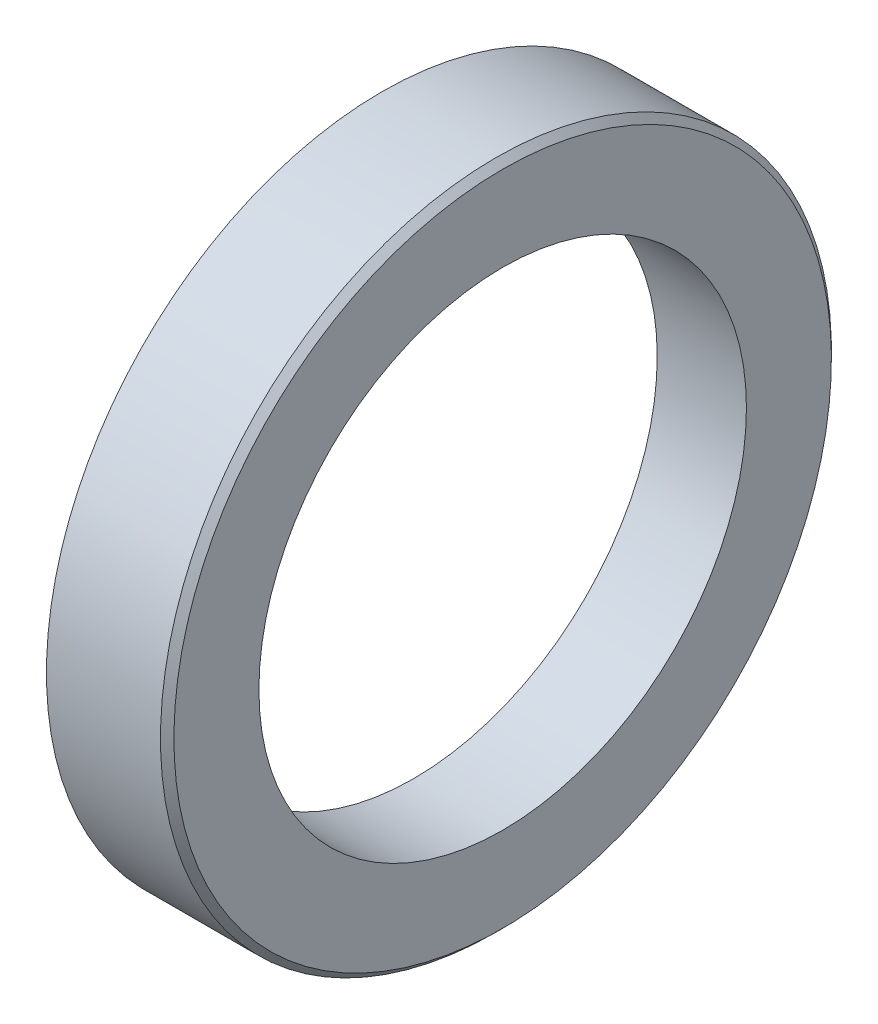
ISO-10303-21;
HEADER;
FILE_DESCRIPTION(('STEP AP214'),'2;1');
FILE_NAME('part.step','',(''),(''),'','','');
FILE_SCHEMA(('AUTOMOTIVE_DESIGN { 1 0 10303 214 1 1 1 1 }'));
ENDSEC;
DATA;
#1=APPLICATION_CONTEXT('core data for automotive mechanical design processes');
#2=APPLICATION_PROTOCOL_DEFINITION('international standard','automotive_design',2000,#1);
#3=PRODUCT_CONTEXT('',#1,'mechanical');
#4=PRODUCT('Part','Part','',(#3));
#5=PRODUCT_RELATED_PRODUCT_CATEGORY('part','',(#4));
#6=PRODUCT_DEFINITION_FORMATION('','',#4);
#7=PRODUCT_DEFINITION_CONTEXT('part definition',#1,'design');
#8=PRODUCT_DEFINITION('design','',#6,#7);
#9=PRODUCT_DEFINITION_SHAPE('','',#8);
#10=(LENGTH_UNIT() NAMED_UNIT(*) SI_UNIT(.MILLI.,.METRE.));
#11=(NAMED_UNIT(*) PLANE_ANGLE_UNIT() SI_UNIT($,.RADIAN.));
#12=(NAMED_UNIT(*) SI_UNIT($,.STERADIAN.) SOLID_ANGLE_UNIT());
#13=UNCERTAINTY_MEASURE_WITH_UNIT(LENGTH_MEASURE(1.E-05),#10,'distance_accuracy_value','');
#14=(GEOMETRIC_REPRESENTATION_CONTEXT(3) GLOBAL_UNCERTAINTY_ASSIGNED_CONTEXT((#13)) GLOBAL_UNIT_ASSIGNED_CONTEXT((#10,
#11,#12)) REPRESENTATION_CONTEXT('',''));
#15=CARTESIAN_POINT('',(0.,0.,0.));
#16=DIRECTION('',(0.,0.,1.));
#17=DIRECTION('',(1.,0.,0.));
#18=AXIS2_PLACEMENT_3D('',#15,#16,#17);
#19=CARTESIAN_POINT('',(14.2875,38.1,0.));
#20=DIRECTION('',(1.,0.,0.));
#21=DIRECTION('',(0.,1.,0.));
#22=AXIS2_PLACEMENT_3D('',#19,#20,#21);
#23=PLANE('',#22);
#24=CARTESIAN_POINT('',(14.2875,0.,0.));
#25=DIRECTION('',(1.,0.,0.));
#26=DIRECTION('',(0.,1.,0.));
#27=AXIS2_PLACEMENT_3D('',#24,#25,#26);
#28=CIRCLE('',#27,37.338);
#29=CARTESIAN_POINT('',(14.2875,37.338,0.));
#30=VERTEX_POINT('',#29);
#31=EDGE_CURVE('E12',#30,#30,#28,.T.);
#32=ORIENTED_EDGE('',*,*,#31,.T.);
#33=EDGE_LOOP('',(#32));
#34=FACE_BOUND('',#33,.T.);
#35=CARTESIAN_POINT('',(14.2875,0.,0.));
#36=DIRECTION('',(1.,0.,0.));
#37=DIRECTION('',(0.,1.,0.));
#38=AXIS2_PLACEMENT_3D('',#35,#36,#37);
#39=CIRCLE('',#38,27.686);
#40=CARTESIAN_POINT('',(14.2875,27.686,0.));
#41=VERTEX_POINT('',#40);
#42=EDGE_CURVE('E70',#41,#41,#39,.T.);
#43=ORIENTED_EDGE('',*,*,#42,.F.);
#44=EDGE_LOOP('',(#43));
#45=FACE_BOUND('',#44,.T.);
#46=ADVANCED_FACE('F47',(#34,#45),#23,.T.);
#47=CARTESIAN_POINT('',(0.,0.,0.));
#48=DIRECTION('',(1.,0.,0.));
#49=DIRECTION('',(0.,1.,0.));
#50=AXIS2_PLACEMENT_3D('',#47,#48,#49);
#51=CYLINDRICAL_SURFACE('',#50,38.1);
#52=CARTESIAN_POINT('',(0.572038002537953,0.,0.));
#53=DIRECTION('',(-1.,0.,0.));
#54=DIRECTION('',(0.,-1.,0.));
#55=AXIS2_PLACEMENT_3D('',#52,#53,#54);
#56=CIRCLE('',#55,38.1);
#57=CARTESIAN_POINT('',(0.572038002537956,-38.1,0.));
#58=VERTEX_POINT('',#57);
#59=EDGE_CURVE('E58',#58,#58,#56,.F.);
#60=ORIENTED_EDGE('',*,*,#59,.T.);
#61=EDGE_LOOP('',(#60));
#62=FACE_BOUND('',#61,.T.);
#63=CARTESIAN_POINT('',(13.5255,0.,0.));
#64=DIRECTION('',(1.,0.,0.));
#65=DIRECTION('',(0.,1.,0.));
#66=AXIS2_PLACEMENT_3D('',#63,#64,#65);
#67=CIRCLE('',#66,38.1);
#68=CARTESIAN_POINT('',(13.5255,38.1,0.));
#69=VERTEX_POINT('',#68);
#70=EDGE_CURVE('E62',#69,#69,#67,.F.);
#71=ORIENTED_EDGE('',*,*,#70,.T.);
#72=EDGE_LOOP('',(#71));
#73=FACE_BOUND('',#72,.T.);
#74=ADVANCED_FACE('F78',(#62,#73),#51,.T.);
#75=CARTESIAN_POINT('',(-80.3218525682768,0.,0.));
#76=DIRECTION('',(1.,0.,0.));
#77=DIRECTION('',(0.,1.,0.));
#78=AXIS2_PLACEMENT_3D('',#75,#76,#77);
#79=SPHERICAL_SURFACE('',#78,88.9);
#80=CARTESIAN_POINT('',(0.32500695399075,0.,0.));
#81=DIRECTION('',(-1.,0.,0.));
#82=DIRECTION('',(0.,-1.,0.));
#83=AXIS2_PLACEMENT_3D('',#80,#81,#82);
#84=CIRCLE('',#83,37.4071390137717);
#85=CARTESIAN_POINT('',(0.325006953990736,37.4071390137717,0.));
#86=VERTEX_POINT('',#85);
#87=EDGE_CURVE('E54',#86,#86,#84,.T.);
#88=CARTESIAN_POINT('',(4.1571117009423,0.,0.));
#89=DIRECTION('',(1.,0.,0.));
#90=DIRECTION('',(0.,1.,0.));
#91=AXIS2_PLACEMENT_3D('',#88,#89,#90);
#92=CIRCLE('',#91,27.686);
#93=CARTESIAN_POINT('',(4.15711170094231,27.686,0.));
#94=VERTEX_POINT('',#93);
#95=EDGE_CURVE('E67',#94,#94,#92,.T.);
#96=CARTESIAN_POINT('',(0.325006953990736,37.4071390137717,0.));
#97=CARTESIAN_POINT('',(0.370833217285072,37.308341184548,0.));
#98=CARTESIAN_POINT('',(0.416477927863079,37.2094591441451,0.));
#99=CARTESIAN_POINT('',(0.507403630933641,37.0115279783693,0.));
#100=CARTESIAN_POINT('',(0.552684623426196,36.9124788529966,0.));
#101=CARTESIAN_POINT('',(0.642882277673063,36.7142148546702,0.));
#102=CARTESIAN_POINT('',(0.687798939427375,36.6149999817166,0.));
#103=CARTESIAN_POINT('',(0.777267325782383,36.4164058284608,0.));
#104=CARTESIAN_POINT('',(0.82181905038308,36.3170265481587,0.));
#105=CARTESIAN_POINT('',(0.91055696059201,36.1181049224969,0.));
#106=CARTESIAN_POINT('',(0.954743146200243,36.0185625771373,0.));
#107=CARTESIAN_POINT('',(1.04274938161726,35.8193161658974,0.));
#108=CARTESIAN_POINT('',(1.08656943142604,35.7196121000172,0.));
#109=CARTESIAN_POINT('',(1.17384280335731,35.520043594446,0.));
#110=CARTESIAN_POINT('',(1.2172961254798,35.4201791547549,0.));
#111=CARTESIAN_POINT('',(1.30383545511181,35.2202912504408,0.));
#112=CARTESIAN_POINT('',(1.34692146262134,35.1202677858179,0.));
#113=CARTESIAN_POINT('',(1.43272558106032,34.9200631826662,0.));
#114=CARTESIAN_POINT('',(1.47544369198978,34.8198820441374,0.));
#115=CARTESIAN_POINT('',(1.56051144027118,34.6193634463303,0.));
#116=CARTESIAN_POINT('',(1.60286107762313,34.5190259870518,0.));
#117=CARTESIAN_POINT('',(1.68719130672899,34.3181961030127,0.));
#118=CARTESIAN_POINT('',(1.72917189848291,34.217703678252,0.));
#119=CARTESIAN_POINT('',(1.81276346935693,34.0165652206089,0.));
#120=CARTESIAN_POINT('',(1.85437444847703,33.9159191877266,0.));
#121=CARTESIAN_POINT('',(1.93722623204003,33.7144748732755,0.));
#122=CARTESIAN_POINT('',(1.97846703648293,33.6136765917069,0.));
#123=CARTESIAN_POINT('',(2.06057791364812,33.4119291413751,0.));
#124=CARTESIAN_POINT('',(2.10144798637041,33.3109799726119,0.));
#125=CARTESIAN_POINT('',(2.18281684805849,33.1089321114211,0.));
#126=CARTESIAN_POINT('',(2.22331563702428,33.0078334189933,0.));
#127=CARTESIAN_POINT('',(2.30394138417841,32.8054878760228,0.));
#128=CARTESIAN_POINT('',(2.34406834236676,32.7042410254799,0.));
#129=CARTESIAN_POINT('',(2.42394988596744,32.5016005338299,0.));
#130=CARTESIAN_POINT('',(2.46370447137978,32.4002068927226,0.));
#131=CARTESIAN_POINT('',(2.54284073245953,32.1972741894771,0.));
#132=CARTESIAN_POINT('',(2.58222240812694,32.0957351273388,0.));
#133=CARTESIAN_POINT('',(2.66061231778486,31.8925129535289,0.));
#134=CARTESIAN_POINT('',(2.69962055177537,31.7908298418572,0.));
#135=CARTESIAN_POINT('',(2.77726305119163,31.5873209424237,0.));
#136=CARTESIAN_POINT('',(2.81589731661737,31.485495154662,0.));
#137=CARTESIAN_POINT('',(2.89279135706745,31.2817022784188,0.));
#138=CARTESIAN_POINT('',(2.93105113209179,31.1797351899373,0.));
#139=CARTESIAN_POINT('',(3.0071956749607,30.9756610895338,0.));
#140=CARTESIAN_POINT('',(3.04508044280527,30.8735540776117,0.));
#141=CARTESIAN_POINT('',(3.12047445960154,30.6692015094959,0.));
#142=CARTESIAN_POINT('',(3.15798370855324,30.5669559533021,0.));
#143=CARTESIAN_POINT('',(3.23262618092286,30.3623276776832,0.));
#144=CARTESIAN_POINT('',(3.26975940434078,30.2599449582581,0.));
#145=CARTESIAN_POINT('',(3.34364932408078,30.0550437390693,0.));
#146=CARTESIAN_POINT('',(3.38040602040286,29.9525252393057,0.));
#147=CARTESIAN_POINT('',(3.4535423894755,29.7473538441672,0.));
#148=CARTESIAN_POINT('',(3.48992206222605,29.6447009487923,0.));
#149=CARTESIAN_POINT('',(3.56230389277045,29.4392621489728,0.));
#150=CARTESIAN_POINT('',(3.5983060505643,29.3364762445283,0.));
#151=CARTESIAN_POINT('',(3.66993236491639,29.1307728149104,0.));
#152=CARTESIAN_POINT('',(3.70555652147463,29.027855289737,0.));
#153=CARTESIAN_POINT('',(3.77642635215581,28.821890008771,0.));
#154=CARTESIAN_POINT('',(3.81167202627875,28.7188422529785,0.));
#155=CARTESIAN_POINT('',(3.88178441610057,28.5126179026757,0.));
#156=CARTESIAN_POINT('',(3.91665113179944,28.4094413081654,0.));
#157=CARTESIAN_POINT('',(3.9860051335346,28.2029606739468,0.));
#158=CARTESIAN_POINT('',(4.02049241957087,28.0996566342385,0.));
#159=CARTESIAN_POINT('',(4.08908709724218,27.8929225053207,0.));
#160=CARTESIAN_POINT('',(4.12319448887721,27.7894924161113,0.));
#161=CARTESIAN_POINT('',(4.15711170094231,27.686,0.));
#162=B_SPLINE_CURVE_WITH_KNOTS('',3,(#96,#97,#98,#99,#100,#101,#102,#103,#104,#105,#106,#107,
#108,#109,#110,#111,#112,#113,#114,#115,#116,#117,#118,#119,#120,#121,#122,#123,#124,#125,#126,
#127,#128,#129,#130,#131,#132,#133,#134,#135,#136,#137,#138,#139,#140,#141,#142,#143,#144,#145,
#146,#147,#148,#149,#150,#151,#152,#153,#154,#155,#156,#157,#158,#159,#160,#161),.UNSPECIFIED.,
.F.,.F.,(4,2,2,2,2,2,2,2,2,2,2,2,2,2,2,2,2,2,2,2,2,2,2,2,2,2,2,2,2,2,2,2,4),(0.,
0.326725262320366,0.653450524640739,0.980175786961112,1.30690104928148,1.63362631160185,
1.96035157392222,2.28707683624259,2.61380209856296,2.94052736088335,3.26725262320371,
3.59397788552408,3.92070314784445,4.24742841016482,4.57415367248519,4.90087893480556,
5.22760419712593,5.55432945944631,5.88105472176667,6.20777998408704,6.53450524640741,
6.86123050872778,7.18795577104815,7.51468103336852,7.84140629568891,8.16813155800928,
8.49485682032965,8.82158208265001,9.14830734497039,9.47503260729076,9.80175786961112,
10.1284831319315,10.4552083942519),.UNSPECIFIED.);
#163=EDGE_CURVE('BSEAM83',#86,#94,#162,.T.);
#164=ORIENTED_EDGE('',*,*,#87,.T.);
#165=ORIENTED_EDGE('',*,*,#95,.T.);
#166=ORIENTED_EDGE('',*,*,#163,.T.);
#167=ORIENTED_EDGE('',*,*,#163,.F.);
#168=EDGE_LOOP('',(#164,#166,#165,#167));
#169=FACE_BOUND('',#168,.T.);
#170=ADVANCED_FACE('F83',(#169),#79,.F.);
#171=CARTESIAN_POINT('',(0.,0.,0.));
#172=DIRECTION('',(1.,0.,0.));
#173=DIRECTION('',(0.,1.,0.));
#174=AXIS2_PLACEMENT_3D('',#171,#172,#173);
#175=CYLINDRICAL_SURFACE('',#174,27.686);
#176=ORIENTED_EDGE('',*,*,#42,.T.);
#177=EDGE_LOOP('',(#176));
#178=FACE_BOUND('',#177,.T.);
#179=ORIENTED_EDGE('',*,*,#95,.F.);
#180=EDGE_LOOP('',(#179));
#181=FACE_BOUND('',#180,.T.);
#182=ADVANCED_FACE('F74',(#178,#181),#175,.F.);
#183=CARTESIAN_POINT('',(0.572038002537953,0.,0.));
#184=DIRECTION('',(1.,0.,0.));
#185=DIRECTION('',(0.,1.,0.));
#186=AXIS2_PLACEMENT_3D('',#183,#184,#185);
#187=CONICAL_SURFACE('',#186,38.1,1.22830920747108);
#188=ORIENTED_EDGE('',*,*,#87,.F.);
#189=EDGE_LOOP('',(#188));
#190=FACE_BOUND('',#189,.T.);
#191=ORIENTED_EDGE('',*,*,#59,.F.);
#192=EDGE_LOOP('',(#191));
#193=FACE_BOUND('',#192,.T.);
#194=ADVANCED_FACE('F87',(#190,#193),#187,.T.);
#195=CARTESIAN_POINT('',(14.2875,0.,0.));
#196=DIRECTION('',(-1.,0.,0.));
#197=DIRECTION('',(0.,-1.,0.));
#198=AXIS2_PLACEMENT_3D('',#195,#196,#197);
#199=CONICAL_SURFACE('',#198,37.338,0.785398163397457);
#200=ORIENTED_EDGE('',*,*,#70,.F.);
#201=EDGE_LOOP('',(#200));
#202=FACE_BOUND('',#201,.T.);
#203=ORIENTED_EDGE('',*,*,#31,.F.);
#204=EDGE_LOOP('',(#203));
#205=FACE_BOUND('',#204,.T.);
#206=ADVANCED_FACE('F49',(#202,#205),#199,.T.);
#207=CLOSED_SHELL('',(#46,#74,#170,#182,#194,#206));
#208=MANIFOLD_SOLID_BREP('B2',#207);
#209=ADVANCED_BREP_SHAPE_REPRESENTATION('',(#18,#208),#14);
#210=SHAPE_DEFINITION_REPRESENTATION(#9,#209);
ENDSEC;
END-ISO-10303-21;
